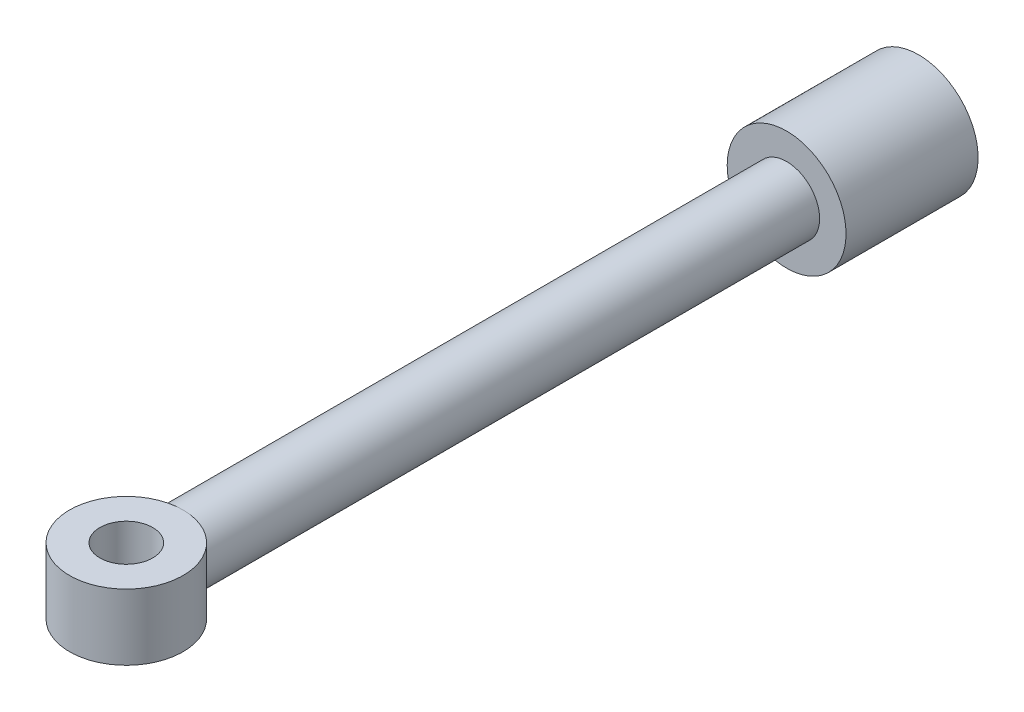
ISO-10303-21;
HEADER;
FILE_DESCRIPTION(('STEP AP214'),'2;1');
FILE_NAME('part.step','',(''),(''),'','','');
FILE_SCHEMA(('AUTOMOTIVE_DESIGN { 1 0 10303 214 1 1 1 1 }'));
ENDSEC;
DATA;
#1=APPLICATION_CONTEXT('core data for automotive mechanical design processes');
#2=APPLICATION_PROTOCOL_DEFINITION('international standard','automotive_design',2000,#1);
#3=PRODUCT_CONTEXT('',#1,'mechanical');
#4=PRODUCT('Part','Part','',(#3));
#5=PRODUCT_RELATED_PRODUCT_CATEGORY('part','',(#4));
#6=PRODUCT_DEFINITION_FORMATION('','',#4);
#7=PRODUCT_DEFINITION_CONTEXT('part definition',#1,'design');
#8=PRODUCT_DEFINITION('design','',#6,#7);
#9=PRODUCT_DEFINITION_SHAPE('','',#8);
#10=(LENGTH_UNIT() NAMED_UNIT(*) SI_UNIT(.MILLI.,.METRE.));
#11=(NAMED_UNIT(*) PLANE_ANGLE_UNIT() SI_UNIT($,.RADIAN.));
#12=(NAMED_UNIT(*) SI_UNIT($,.STERADIAN.) SOLID_ANGLE_UNIT());
#13=UNCERTAINTY_MEASURE_WITH_UNIT(LENGTH_MEASURE(1.E-05),#10,'distance_accuracy_value','');
#14=(GEOMETRIC_REPRESENTATION_CONTEXT(3) GLOBAL_UNCERTAINTY_ASSIGNED_CONTEXT((#13)) GLOBAL_UNIT_ASSIGNED_CONTEXT((#10,
#11,#12)) REPRESENTATION_CONTEXT('',''));
#15=CARTESIAN_POINT('',(0.,0.,0.));
#16=DIRECTION('',(0.,0.,1.));
#17=DIRECTION('',(1.,0.,0.));
#18=AXIS2_PLACEMENT_3D('',#15,#16,#17);
#19=CARTESIAN_POINT('',(0.,0.,75.));
#20=DIRECTION('',(0.,0.,-1.));
#21=DIRECTION('',(-1.,0.,0.));
#22=AXIS2_PLACEMENT_3D('',#19,#20,#21);
#23=CYLINDRICAL_SURFACE('',#22,25.);
#24=CARTESIAN_POINT('',(0.,0.,175.));
#25=DIRECTION('',(0.,0.,-1.));
#26=DIRECTION('',(-1.,0.,0.));
#27=AXIS2_PLACEMENT_3D('',#24,#25,#26);
#28=CIRCLE('',#27,25.);
#29=CARTESIAN_POINT('',(-25.,0.,175.));
#30=VERTEX_POINT('',#29);
#31=EDGE_CURVE('E63',#30,#30,#28,.T.);
#32=ORIENTED_EDGE('',*,*,#31,.F.);
#33=EDGE_LOOP('',(#32));
#34=FACE_BOUND('',#33,.T.);
#35=CARTESIAN_POINT('',(0.,25.,632.));
#36=CARTESIAN_POINT('',(-0.323073219483395,25.0000073405273,631.999991917627));
#37=CARTESIAN_POINT('',(-0.646141502338064,24.9937375418738,632.003640863775));
#38=CARTESIAN_POINT('',(-1.2916200194669,24.9686991510117,632.018192836309));
#39=CARTESIAN_POINT('',(-1.61403027385899,24.9499309468376,632.029095637485));
#40=CARTESIAN_POINT('',(-2.25741128983297,24.8999631376806,632.058088437141));
#41=CARTESIAN_POINT('',(-2.57838266443134,24.8687694638436,632.076175006525));
#42=CARTESIAN_POINT('',(-3.2183878616572,24.7940682668799,632.119411054166));
#43=CARTESIAN_POINT('',(-3.53742167778221,24.7505607024509,632.144560556112));
#44=CARTESIAN_POINT('',(-4.48730779691503,24.6022973988042,632.230076116417));
#45=CARTESIAN_POINT('',(-5.11455128542021,24.4795184962339,632.300674658644));
#46=CARTESIAN_POINT('',(-6.35450877170138,24.1873147832337,632.467519884291));
#47=CARTESIAN_POINT('',(-6.96722161414907,24.0178862771203,632.563768599754));
#48=CARTESIAN_POINT('',(-8.17325775073619,23.6346675452906,632.77947806231));
#49=CARTESIAN_POINT('',(-8.76661117389671,23.4209504719296,632.898900512425));
#50=CARTESIAN_POINT('',(-9.93159556183181,22.9512078223228,633.158398406019));
#51=CARTESIAN_POINT('',(-10.5032266492576,22.6951824850066,633.298473732864));
#52=CARTESIAN_POINT('',(-11.6225774564603,22.1428459411344,633.596479530529));
#53=CARTESIAN_POINT('',(-12.1702716259285,21.8464930125045,633.75442846412));
#54=CARTESIAN_POINT('',(-13.2388292536092,21.2159917334919,634.084889987469));
#55=CARTESIAN_POINT('',(-13.7596915345781,20.8818417268222,634.257403215356));
#56=CARTESIAN_POINT('',(-14.8097037618994,20.152189070235,634.626684737254));
#57=CARTESIAN_POINT('',(-15.3366791442554,19.7539876429895,634.824304274079));
#58=CARTESIAN_POINT('',(-16.355570131578,18.9190176170641,635.228204609291));
#59=CARTESIAN_POINT('',(-16.8474842861503,18.4822474245634,635.434485765428));
#60=CARTESIAN_POINT('',(-17.7949550173283,17.5718979612227,635.851465937347));
#61=CARTESIAN_POINT('',(-18.2504761742981,17.0982836954338,636.062169010958));
#62=CARTESIAN_POINT('',(-19.1229526377762,16.1165747091056,636.483155088647));
#63=CARTESIAN_POINT('',(-19.5399059530893,15.6084782106497,636.693438070489));
#64=CARTESIAN_POINT('',(-20.3786164952388,14.4999450687305,637.132326474249));
#65=CARTESIAN_POINT('',(-20.7955295482988,13.8955778996803,637.36029664006));
#66=CARTESIAN_POINT('',(-21.576620180258,12.6487421591043,637.802540616851));
#67=CARTESIAN_POINT('',(-21.9407898478575,12.0062678919936,638.016812370435));
#68=CARTESIAN_POINT('',(-22.6127328991702,10.6869824653494,638.42379930329));
#69=CARTESIAN_POINT('',(-22.9205777197122,10.0102162099253,638.616541665673));
#70=CARTESIAN_POINT('',(-23.4767842757009,8.6253626691367,638.972928714695));
#71=CARTESIAN_POINT('',(-23.7251664515645,7.91728624615681,639.136583395293));
#72=CARTESIAN_POINT('',(-24.1092135452026,6.63955323298851,639.394012848847));
#73=CARTESIAN_POINT('',(-24.2576658880458,6.07520751593126,639.495211205358));
#74=CARTESIAN_POINT('',(-24.5153025535408,4.93376834216414,639.672610024112));
#75=CARTESIAN_POINT('',(-24.624492741889,4.35667680334266,639.74881422029));
#76=CARTESIAN_POINT('',(-24.8021169016052,3.19383705209393,639.873559654141));
#77=CARTESIAN_POINT('',(-24.8705893792807,2.60809755702331,639.922127025787));
#78=CARTESIAN_POINT('',(-24.9659584223035,1.43151915987226,639.989938896084));
#79=CARTESIAN_POINT('',(-24.9928541916902,0.840680160382694,640.009182833357));
#80=CARTESIAN_POINT('',(-25.0046644537355,-0.342553531027833,640.017621374833));
#81=CARTESIAN_POINT('',(-24.9895136493183,-0.934949213713494,640.006769240754));
#82=CARTESIAN_POINT('',(-24.9173247406087,-2.11586738550415,639.95533043359));
#83=CARTESIAN_POINT('',(-24.8602864559335,-2.70438985791867,639.914743632457));
#84=CARTESIAN_POINT('',(-24.705118667433,-3.87365051320265,639.805311753864));
#85=CARTESIAN_POINT('',(-24.6069650173244,-4.45438391452941,639.736450071568));
#86=CARTESIAN_POINT('',(-24.3708826196281,-5.60396788159319,639.572882645657));
#87=CARTESIAN_POINT('',(-24.2329529294205,-6.17281816537925,639.478176289573));
#88=CARTESIAN_POINT('',(-23.9200588841416,-7.29148537237561,639.266736481832));
#89=CARTESIAN_POINT('',(-23.7453650735209,-7.84140893784096,639.150164583484));
#90=CARTESIAN_POINT('',(-23.3599923313202,-8.9241898838764,638.897870163549));
#91=CARTESIAN_POINT('',(-23.149298868061,-9.45704026910449,638.762139912332));
#92=CARTESIAN_POINT('',(-22.693655001516,-10.5035103373492,638.47507028058));
#93=CARTESIAN_POINT('',(-22.4487039520211,-11.017129657374,638.323730605615));
#94=CARTESIAN_POINT('',(-21.9261058615668,-12.0236223707595,638.008934340018));
#95=CARTESIAN_POINT('',(-21.6484550342577,-12.5164933526563,637.845476347003));
#96=CARTESIAN_POINT('',(-21.0133747545136,-13.5598748043819,637.482096451958));
#97=CARTESIAN_POINT('',(-20.6503450688302,-14.1064404244398,637.280614309169));
#98=CARTESIAN_POINT('',(-19.8838315939996,-15.1677892371371,636.870980814586));
#99=CARTESIAN_POINT('',(-19.4803443889607,-15.6825697401703,636.662828900663));
#100=CARTESIAN_POINT('',(-18.6343106730208,-16.6790289504847,636.244544541118));
#101=CARTESIAN_POINT('',(-18.1917279308608,-17.1606762010386,636.034410423032));
#102=CARTESIAN_POINT('',(-17.2695024774644,-18.0884534042603,635.617002238479));
#103=CARTESIAN_POINT('',(-16.7898579259702,-18.5345815910375,635.409728314636));
#104=CARTESIAN_POINT('',(-15.7338572628011,-19.4419172482329,634.977381346595));
#105=CARTESIAN_POINT('',(-15.1528672405292,-19.8982075430565,634.753262732965));
#106=CARTESIAN_POINT('',(-13.9488810741165,-20.7599803780785,634.320300022891));
#107=CARTESIAN_POINT('',(-13.3258810956642,-21.1654582708725,634.111457324338));
#108=CARTESIAN_POINT('',(-12.0423003328998,-21.9211449030045,633.715217486015));
#109=CARTESIAN_POINT('',(-11.3817895732271,-22.2714523003018,633.527782233517));
#110=CARTESIAN_POINT('',(-10.0262438133686,-22.9136791762596,633.179384301884));
#111=CARTESIAN_POINT('',(-9.33121177846103,-23.2056036590542,633.018419354127));
#112=CARTESIAN_POINT('',(-7.94372462011021,-23.7153694620421,632.734458317691));
#113=CARTESIAN_POINT('',(-7.25255984764812,-23.935952478089,632.610080026113));
#114=CARTESIAN_POINT('',(-5.84882965497466,-24.3170639383683,632.393722450943));
#115=CARTESIAN_POINT('',(-5.13626793238096,-24.4776026950914,632.301737603994));
#116=CARTESIAN_POINT('',(-4.05369539716518,-24.671920503785,632.189943321606));
#117=CARTESIAN_POINT('',(-3.68905733973753,-24.7290793691959,632.156963391952));
#118=CARTESIAN_POINT('',(-2.9568704320822,-24.8272688018788,632.100213911025));
#119=CARTESIAN_POINT('',(-2.58932160100161,-24.8682994751525,632.076444299219));
#120=CARTESIAN_POINT('',(-1.85197952858847,-24.9340583440999,632.038313404299));
#121=CARTESIAN_POINT('',(-1.48218467381488,-24.9587729425175,632.023959968366));
#122=CARTESIAN_POINT('',(-0.741596033911651,-24.9917505720782,632.004796005514));
#123=CARTESIAN_POINT('',(-0.370802195670504,-25.000012710516,631.999985996419));
#124=CARTESIAN_POINT('',(0.,-25.,632.));
#125=B_SPLINE_CURVE_WITH_KNOTS('',3,(#35,#36,#37,#38,#39,#40,#41,#42,#43,#44,#45,#46,#47,#48,
#49,#50,#51,#52,#53,#54,#55,#56,#57,#58,#59,#60,#61,#62,#63,#64,#65,#66,#67,#68,#69,#70,#71,#72,
#73,#74,#75,#76,#77,#78,#79,#80,#81,#82,#83,#84,#85,#86,#87,#88,#89,#90,#91,#92,#93,#94,#95,#96,
#97,#98,#99,#100,#101,#102,#103,#104,#105,#106,#107,#108,#109,#110,#111,#112,#113,#114,#115,
#116,#117,#118,#119,#120,#121,#122,#123,#124),.UNSPECIFIED.,.F.,.F.,(4,2,2,2,2,2,2,2,2,2,2,2,2,
2,2,2,2,2,2,2,2,2,2,2,2,2,2,2,2,2,2,2,2,2,2,2,2,2,2,2,2,2,2,2,4),(0.,0.969129286855337,
1.93822848683209,2.90686565243428,3.87550606700364,5.80196075601256,7.72856810690568,
9.65201824772572,11.5754575265228,13.500902102308,15.4264310847567,17.4926341354823,
19.5589226102521,21.6271982123862,23.695580536709,25.9991410406336,28.3030467124911,
30.6040097719282,32.9041807307745,34.6791412126934,36.4538364083726,38.2268506135154,
39.9998987615087,41.775701940575,43.551512766942,45.3283679591154,47.1052652629894,
48.8695171920972,50.6344829718386,52.3994820490406,54.1646856990844,56.2217681123881,
58.2790243548663,60.3382075449279,62.3974930469429,64.7105585581636,67.0238354728348,
69.3329275414591,71.6418216075804,73.8468588699269,76.0515172471042,77.1628077730092,
78.2740909949048,79.3862991569077,80.4985676653297),.UNSPECIFIED.);
#126=CARTESIAN_POINT('',(0.,25.,632.));
#127=VERTEX_POINT('',#126);
#128=CARTESIAN_POINT('',(0.,-25.,632.));
#129=VERTEX_POINT('',#128);
#130=EDGE_CURVE('E52',#127,#129,#125,.T.);
#131=ORIENTED_EDGE('',*,*,#130,.F.);
#132=CARTESIAN_POINT('',(0.,-25.,632.));
#133=CARTESIAN_POINT('',(0.323073219483536,-25.0000073405273,631.999991917627));
#134=CARTESIAN_POINT('',(0.646141502338205,-24.9937375418738,632.003640863775));
#135=CARTESIAN_POINT('',(1.29162001946704,-24.9686991510117,632.018192836309));
#136=CARTESIAN_POINT('',(1.61403027385913,-24.9499309468376,632.029095637485));
#137=CARTESIAN_POINT('',(2.25741128983311,-24.8999631376806,632.058088437141));
#138=CARTESIAN_POINT('',(2.57838266443148,-24.8687694638436,632.076175006525));
#139=CARTESIAN_POINT('',(3.21838786165734,-24.7940682668799,632.119411054166));
#140=CARTESIAN_POINT('',(3.53742167778235,-24.7505607024509,632.144560556112));
#141=CARTESIAN_POINT('',(4.48730779691518,-24.6022973988042,632.230076116417));
#142=CARTESIAN_POINT('',(5.11455128542035,-24.4795184962339,632.300674658644));
#143=CARTESIAN_POINT('',(6.35450877170152,-24.1873147832337,632.467519884291));
#144=CARTESIAN_POINT('',(6.96722161414922,-24.0178862771203,632.563768599754));
#145=CARTESIAN_POINT('',(8.17325775073634,-23.6346675452906,632.77947806231));
#146=CARTESIAN_POINT('',(8.76661117389687,-23.4209504719296,632.898900512425));
#147=CARTESIAN_POINT('',(9.93159556183198,-22.9512078223228,633.158398406019));
#148=CARTESIAN_POINT('',(10.5032266492578,-22.6951824850066,633.298473732864));
#149=CARTESIAN_POINT('',(11.6225774564605,-22.1428459411344,633.596479530529));
#150=CARTESIAN_POINT('',(12.1702716259286,-21.8464930125045,633.75442846412));
#151=CARTESIAN_POINT('',(13.2388292536093,-21.2159917334919,634.084889987469));
#152=CARTESIAN_POINT('',(13.7596915345782,-20.8818417268222,634.257403215356));
#153=CARTESIAN_POINT('',(14.8097037618995,-20.152189070235,634.626684737254));
#154=CARTESIAN_POINT('',(15.3366791442555,-19.7539876429895,634.824304274079));
#155=CARTESIAN_POINT('',(16.3555701315781,-18.9190176170641,635.228204609291));
#156=CARTESIAN_POINT('',(16.8474842861504,-18.4822474245634,635.434485765428));
#157=CARTESIAN_POINT('',(17.7949550173284,-17.5718979612226,635.851465937347));
#158=CARTESIAN_POINT('',(18.2504761742982,-17.0982836954337,636.062169010958));
#159=CARTESIAN_POINT('',(19.1229526377764,-16.1165747091056,636.483155088647));
#160=CARTESIAN_POINT('',(19.5399059530895,-15.6084782106497,636.693438070489));
#161=CARTESIAN_POINT('',(20.378616495239,-14.4999450687305,637.132326474249));
#162=CARTESIAN_POINT('',(20.7955295482989,-13.8955778996803,637.36029664006));
#163=CARTESIAN_POINT('',(21.5766201802581,-12.6487421591043,637.802540616851));
#164=CARTESIAN_POINT('',(21.9407898478576,-12.0062678919936,638.016812370435));
#165=CARTESIAN_POINT('',(22.6127328991703,-10.6869824653493,638.42379930329));
#166=CARTESIAN_POINT('',(22.9205777197124,-10.0102162099253,638.616541665673));
#167=CARTESIAN_POINT('',(23.4767842757011,-8.62536266913668,638.972928714695));
#168=CARTESIAN_POINT('',(23.7251664515646,-7.91728624615679,639.136583395293));
#169=CARTESIAN_POINT('',(24.1092135452027,-6.63955323298848,639.394012848847));
#170=CARTESIAN_POINT('',(24.2576658880459,-6.07520751593123,639.495211205358));
#171=CARTESIAN_POINT('',(24.5153025535409,-4.9337683421641,639.672610024112));
#172=CARTESIAN_POINT('',(24.6244927418891,-4.35667680334262,639.74881422029));
#173=CARTESIAN_POINT('',(24.8021169016054,-3.19383705209389,639.873559654141));
#174=CARTESIAN_POINT('',(24.8705893792808,-2.60809755702327,639.922127025787));
#175=CARTESIAN_POINT('',(24.9659584223036,-1.43151915987223,639.989938896084));
#176=CARTESIAN_POINT('',(24.9928541916903,-0.840680160382664,640.009182833357));
#177=CARTESIAN_POINT('',(25.0046644537356,0.342553531027863,640.017621374833));
#178=CARTESIAN_POINT('',(24.9895136493184,0.934949213713527,640.006769240754));
#179=CARTESIAN_POINT('',(24.9173247406088,2.11586738550418,639.95533043359));
#180=CARTESIAN_POINT('',(24.8602864559336,2.7043898579187,639.914743632457));
#181=CARTESIAN_POINT('',(24.7051186674332,3.87365051320269,639.805311753864));
#182=CARTESIAN_POINT('',(24.6069650173246,4.45438391452944,639.736450071568));
#183=CARTESIAN_POINT('',(24.3708826196282,5.60396788159321,639.572882645657));
#184=CARTESIAN_POINT('',(24.2329529294206,6.17281816537928,639.478176289573));
#185=CARTESIAN_POINT('',(23.9200588841418,7.29148537237564,639.266736481832));
#186=CARTESIAN_POINT('',(23.745365073521,7.84140893784098,639.150164583484));
#187=CARTESIAN_POINT('',(23.3599923313203,8.92418988387642,638.897870163549));
#188=CARTESIAN_POINT('',(23.1492988680612,9.45704026910451,638.762139912332));
#189=CARTESIAN_POINT('',(22.6936550015161,10.5035103373492,638.47507028058));
#190=CARTESIAN_POINT('',(22.4487039520212,11.017129657374,638.323730605615));
#191=CARTESIAN_POINT('',(21.9261058615669,12.0236223707595,638.008934340018));
#192=CARTESIAN_POINT('',(21.6484550342578,12.5164933526564,637.845476347003));
#193=CARTESIAN_POINT('',(21.0133747545137,13.5598748043819,637.482096451958));
#194=CARTESIAN_POINT('',(20.6503450688303,14.1064404244398,637.280614309169));
#195=CARTESIAN_POINT('',(19.8838315939998,15.1677892371372,636.870980814586));
#196=CARTESIAN_POINT('',(19.4803443889608,15.6825697401703,636.662828900663));
#197=CARTESIAN_POINT('',(18.6343106730209,16.6790289504848,636.244544541118));
#198=CARTESIAN_POINT('',(18.1917279308609,17.1606762010386,636.034410423032));
#199=CARTESIAN_POINT('',(17.2695024774645,18.0884534042604,635.617002238479));
#200=CARTESIAN_POINT('',(16.7898579259703,18.5345815910375,635.409728314636));
#201=CARTESIAN_POINT('',(15.7338572628012,19.4419172482329,634.977381346595));
#202=CARTESIAN_POINT('',(15.1528672405293,19.8982075430565,634.753262732965));
#203=CARTESIAN_POINT('',(13.9488810741166,20.7599803780785,634.320300022891));
#204=CARTESIAN_POINT('',(13.3258810956643,21.1654582708725,634.111457324338));
#205=CARTESIAN_POINT('',(12.0423003328999,21.9211449030045,633.715217486015));
#206=CARTESIAN_POINT('',(11.3817895732273,22.2714523003018,633.527782233517));
#207=CARTESIAN_POINT('',(10.0262438133687,22.9136791762596,633.179384301884));
#208=CARTESIAN_POINT('',(9.33121177846114,23.2056036590542,633.018419354127));
#209=CARTESIAN_POINT('',(7.9437246201103,23.7153694620421,632.734458317691));
#210=CARTESIAN_POINT('',(7.25255984764822,23.935952478089,632.610080026113));
#211=CARTESIAN_POINT('',(5.84882965497476,24.3170639383683,632.393722450943));
#212=CARTESIAN_POINT('',(5.13626793238107,24.4776026950914,632.301737603994));
#213=CARTESIAN_POINT('',(4.05369539716531,24.671920503785,632.189943321606));
#214=CARTESIAN_POINT('',(3.68905733973766,24.7290793691959,632.156963391952));
#215=CARTESIAN_POINT('',(2.95687043208234,24.8272688018788,632.100213911025));
#216=CARTESIAN_POINT('',(2.58932160100175,24.8682994751525,632.076444299219));
#217=CARTESIAN_POINT('',(1.85197952858861,24.9340583440999,632.038313404299));
#218=CARTESIAN_POINT('',(1.48218467381501,24.9587729425175,632.023959968366));
#219=CARTESIAN_POINT('',(0.741596033911784,24.9917505720782,632.004796005514));
#220=CARTESIAN_POINT('',(0.370802195670638,25.000012710516,631.999985996419));
#221=CARTESIAN_POINT('',(0.,25.,632.));
#222=B_SPLINE_CURVE_WITH_KNOTS('',3,(#132,#133,#134,#135,#136,#137,#138,#139,#140,#141,#142,
#143,#144,#145,#146,#147,#148,#149,#150,#151,#152,#153,#154,#155,#156,#157,#158,#159,#160,#161,
#162,#163,#164,#165,#166,#167,#168,#169,#170,#171,#172,#173,#174,#175,#176,#177,#178,#179,#180,
#181,#182,#183,#184,#185,#186,#187,#188,#189,#190,#191,#192,#193,#194,#195,#196,#197,#198,#199,
#200,#201,#202,#203,#204,#205,#206,#207,#208,#209,#210,#211,#212,#213,#214,#215,#216,#217,#218,
#219,#220,#221),.UNSPECIFIED.,.F.,.F.,(4,2,2,2,2,2,2,2,2,2,2,2,2,2,2,2,2,2,2,2,2,2,2,2,2,2,2,2,
2,2,2,2,2,2,2,2,2,2,2,2,2,2,2,2,4),(0.,0.969129286855336,1.93822848683208,2.90686565243428,
3.87550606700363,5.80196075601256,7.72856810690568,9.65201824772575,11.5754575265229,
13.500902102308,15.4264310847567,17.4926341354823,19.5589226102521,21.6271982123862,
23.695580536709,25.9991410406336,28.3030467124911,30.6040097719282,32.9041807307745,
34.6791412126934,36.4538364083727,38.2268506135154,39.9998987615087,41.775701940575,
43.551512766942,45.3283679591154,47.1052652629894,48.8695171920972,50.6344829718385,
52.3994820490406,54.1646856990844,56.2217681123881,58.2790243548664,60.3382075449279,
62.3974930469429,64.7105585581636,67.0238354728348,69.3329275414591,71.6418216075805,
73.8468588699269,76.0515172471042,77.1628077730092,78.2740909949048,79.3862991569077,
80.4985676653297),.UNSPECIFIED.);
#223=EDGE_CURVE('E55',#129,#127,#222,.T.);
#224=ORIENTED_EDGE('',*,*,#223,.F.);
#225=EDGE_LOOP('',(#131,#224));
#226=FACE_BOUND('',#225,.T.);
#227=ADVANCED_FACE('F37',(#34,#226),#23,.T.);
#228=CARTESIAN_POINT('',(0.,0.,75.));
#229=DIRECTION('',(0.,0.,1.));
#230=DIRECTION('',(1.,0.,0.));
#231=AXIS2_PLACEMENT_3D('',#228,#229,#230);
#232=PLANE('',#231);
#233=CARTESIAN_POINT('',(0.,0.,75.));
#234=DIRECTION('',(0.,0.,-1.));
#235=DIRECTION('',(-1.,0.,0.));
#236=AXIS2_PLACEMENT_3D('',#233,#234,#235);
#237=CIRCLE('',#236,45.);
#238=CARTESIAN_POINT('',(-45.,0.,75.));
#239=VERTEX_POINT('',#238);
#240=EDGE_CURVE('E11',#239,#239,#237,.T.);
#241=ORIENTED_EDGE('',*,*,#240,.T.);
#242=EDGE_LOOP('',(#241));
#243=FACE_BOUND('',#242,.T.);
#244=ADVANCED_FACE('F39',(#243),#232,.F.);
#245=CARTESIAN_POINT('',(0.,0.,75.));
#246=DIRECTION('',(0.,0.,-1.));
#247=DIRECTION('',(-1.,0.,0.));
#248=AXIS2_PLACEMENT_3D('',#245,#246,#247);
#249=CYLINDRICAL_SURFACE('',#248,45.);
#250=ORIENTED_EDGE('',*,*,#240,.F.);
#251=EDGE_LOOP('',(#250));
#252=FACE_BOUND('',#251,.T.);
#253=CARTESIAN_POINT('',(0.,0.,175.));
#254=DIRECTION('',(0.,0.,-1.));
#255=DIRECTION('',(-1.,0.,0.));
#256=AXIS2_PLACEMENT_3D('',#253,#254,#255);
#257=CIRCLE('',#256,45.);
#258=CARTESIAN_POINT('',(-45.,0.,175.));
#259=VERTEX_POINT('',#258);
#260=EDGE_CURVE('E45',#259,#259,#257,.T.);
#261=ORIENTED_EDGE('',*,*,#260,.T.);
#262=EDGE_LOOP('',(#261));
#263=FACE_BOUND('',#262,.T.);
#264=ADVANCED_FACE('F110',(#252,#263),#249,.T.);
#265=CARTESIAN_POINT('',(45.,0.,175.));
#266=DIRECTION('',(0.,0.,-1.));
#267=DIRECTION('',(-1.,0.,0.));
#268=AXIS2_PLACEMENT_3D('',#265,#266,#267);
#269=PLANE('',#268);
#270=ORIENTED_EDGE('',*,*,#260,.F.);
#271=EDGE_LOOP('',(#270));
#272=FACE_BOUND('',#271,.T.);
#273=ORIENTED_EDGE('',*,*,#31,.T.);
#274=EDGE_LOOP('',(#273));
#275=FACE_BOUND('',#274,.T.);
#276=ADVANCED_FACE('F90',(#272,#275),#269,.F.);
#277=CARTESIAN_POINT('',(0.,25.,675.));
#278=DIRECTION('',(0.,-1.,0.));
#279=DIRECTION('',(0.,0.,-1.));
#280=AXIS2_PLACEMENT_3D('',#277,#278,#279);
#281=CYLINDRICAL_SURFACE('',#280,43.);
#282=CARTESIAN_POINT('',(0.,25.,675.));
#283=DIRECTION('',(0.,1.,0.));
#284=DIRECTION('',(0.,0.,1.));
#285=AXIS2_PLACEMENT_3D('',#282,#283,#284);
#286=CIRCLE('',#285,43.);
#287=EDGE_CURVE('E58',#127,#127,#286,.T.);
#288=ORIENTED_EDGE('',*,*,#287,.F.);
#289=ORIENTED_EDGE('',*,*,#130,.T.);
#290=CARTESIAN_POINT('',(0.,-25.,675.));
#291=DIRECTION('',(0.,1.,0.));
#292=DIRECTION('',(0.,0.,1.));
#293=AXIS2_PLACEMENT_3D('',#290,#291,#292);
#294=CIRCLE('',#293,43.);
#295=EDGE_CURVE('E60',#129,#129,#294,.T.);
#296=ORIENTED_EDGE('',*,*,#295,.T.);
#297=ORIENTED_EDGE('',*,*,#223,.T.);
#298=EDGE_LOOP('',(#288,#289,#296,#297));
#299=FACE_BOUND('',#298,.T.);
#300=ADVANCED_FACE('F56',(#299),#281,.T.);
#301=CARTESIAN_POINT('',(0.,25.,675.));
#302=DIRECTION('',(0.,1.,0.));
#303=DIRECTION('',(0.,0.,1.));
#304=AXIS2_PLACEMENT_3D('',#301,#302,#303);
#305=PLANE('',#304);
#306=ORIENTED_EDGE('',*,*,#287,.T.);
#307=EDGE_LOOP('',(#306));
#308=FACE_BOUND('',#307,.T.);
#309=CARTESIAN_POINT('',(0.,25.,675.));
#310=DIRECTION('',(0.,1.,0.));
#311=DIRECTION('',(0.,0.,1.));
#312=AXIS2_PLACEMENT_3D('',#309,#310,#311);
#313=CIRCLE('',#312,20.);
#314=CARTESIAN_POINT('',(0.,25.,695.));
#315=VERTEX_POINT('',#314);
#316=EDGE_CURVE('E69',#315,#315,#313,.T.);
#317=ORIENTED_EDGE('',*,*,#316,.F.);
#318=EDGE_LOOP('',(#317));
#319=FACE_BOUND('',#318,.T.);
#320=ADVANCED_FACE('F66',(#308,#319),#305,.T.);
#321=CARTESIAN_POINT('',(0.,-25.,675.));
#322=DIRECTION('',(0.,1.,0.));
#323=DIRECTION('',(0.,0.,1.));
#324=AXIS2_PLACEMENT_3D('',#321,#322,#323);
#325=PLANE('',#324);
#326=ORIENTED_EDGE('',*,*,#295,.F.);
#327=EDGE_LOOP('',(#326));
#328=FACE_BOUND('',#327,.T.);
#329=CARTESIAN_POINT('',(0.,-25.,675.));
#330=DIRECTION('',(0.,1.,0.));
#331=DIRECTION('',(0.,0.,1.));
#332=AXIS2_PLACEMENT_3D('',#329,#330,#331);
#333=CIRCLE('',#332,20.);
#334=CARTESIAN_POINT('',(0.,-25.,695.));
#335=VERTEX_POINT('',#334);
#336=EDGE_CURVE('E72',#335,#335,#333,.T.);
#337=ORIENTED_EDGE('',*,*,#336,.T.);
#338=EDGE_LOOP('',(#337));
#339=FACE_BOUND('',#338,.T.);
#340=ADVANCED_FACE('F91',(#328,#339),#325,.F.);
#341=CARTESIAN_POINT('',(0.,25.,675.));
#342=DIRECTION('',(0.,-1.,0.));
#343=DIRECTION('',(0.,0.,-1.));
#344=AXIS2_PLACEMENT_3D('',#341,#342,#343);
#345=CYLINDRICAL_SURFACE('',#344,20.);
#346=ORIENTED_EDGE('',*,*,#316,.T.);
#347=EDGE_LOOP('',(#346));
#348=FACE_BOUND('',#347,.T.);
#349=ORIENTED_EDGE('',*,*,#336,.F.);
#350=EDGE_LOOP('',(#349));
#351=FACE_BOUND('',#350,.T.);
#352=ADVANCED_FACE('F95',(#348,#351),#345,.F.);
#353=CLOSED_SHELL('',(#227,#244,#264,#276,#300,#320,#340,#352));
#354=MANIFOLD_SOLID_BREP('B2',#353);
#355=ADVANCED_BREP_SHAPE_REPRESENTATION('',(#18,#354),#14);
#356=SHAPE_DEFINITION_REPRESENTATION(#9,#355);
ENDSEC;
END-ISO-10303-21;
